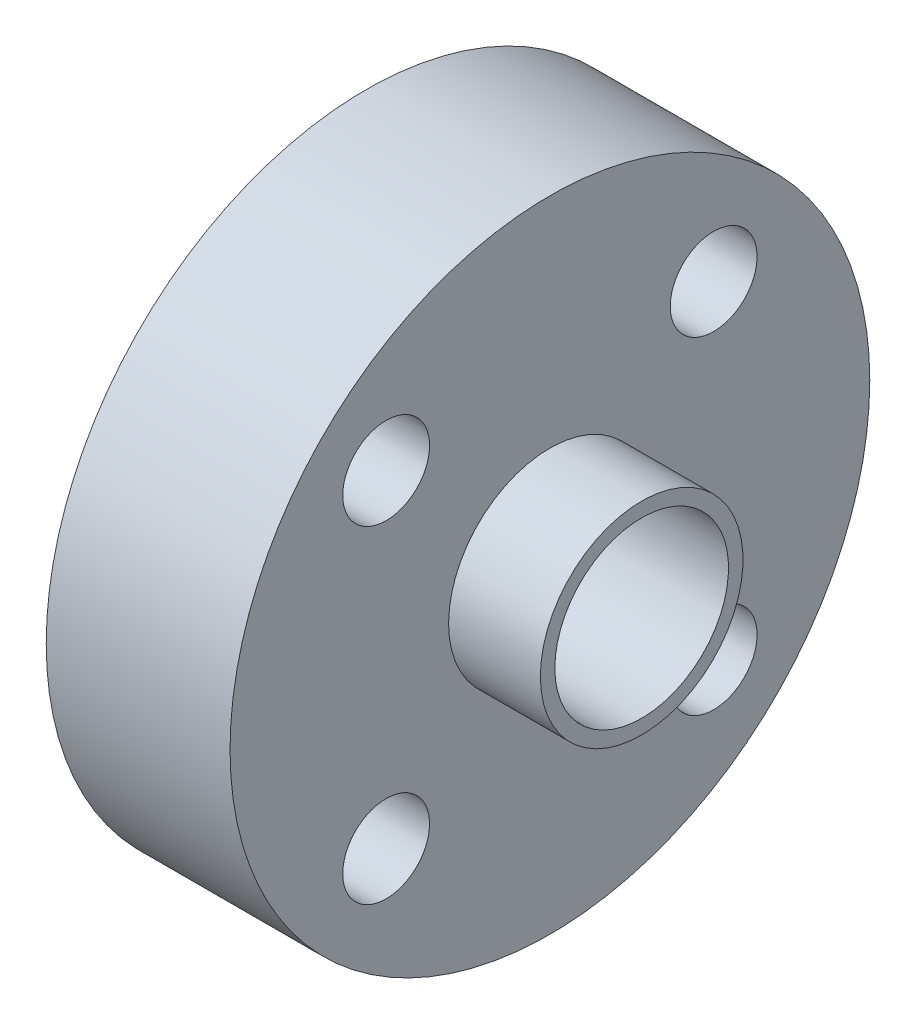
ISO-10303-21;
HEADER;
FILE_DESCRIPTION(('STEP AP214'),'2;1');
FILE_NAME('part.step','',(''),(''),'','','');
FILE_SCHEMA(('AUTOMOTIVE_DESIGN { 1 0 10303 214 1 1 1 1 }'));
ENDSEC;
DATA;
#1=APPLICATION_CONTEXT('core data for automotive mechanical design processes');
#2=APPLICATION_PROTOCOL_DEFINITION('international standard','automotive_design',2000,#1);
#3=PRODUCT_CONTEXT('',#1,'mechanical');
#4=PRODUCT('Part','Part','',(#3));
#5=PRODUCT_RELATED_PRODUCT_CATEGORY('part','',(#4));
#6=PRODUCT_DEFINITION_FORMATION('','',#4);
#7=PRODUCT_DEFINITION_CONTEXT('part definition',#1,'design');
#8=PRODUCT_DEFINITION('design','',#6,#7);
#9=PRODUCT_DEFINITION_SHAPE('','',#8);
#10=(LENGTH_UNIT() NAMED_UNIT(*) SI_UNIT(.MILLI.,.METRE.));
#11=(NAMED_UNIT(*) PLANE_ANGLE_UNIT() SI_UNIT($,.RADIAN.));
#12=(NAMED_UNIT(*) SI_UNIT($,.STERADIAN.) SOLID_ANGLE_UNIT());
#13=UNCERTAINTY_MEASURE_WITH_UNIT(LENGTH_MEASURE(1.E-05),#10,'distance_accuracy_value','');
#14=(GEOMETRIC_REPRESENTATION_CONTEXT(3) GLOBAL_UNCERTAINTY_ASSIGNED_CONTEXT((#13)) GLOBAL_UNIT_ASSIGNED_CONTEXT((#10,
#11,#12)) REPRESENTATION_CONTEXT('',''));
#15=CARTESIAN_POINT('',(0.,0.,0.));
#16=DIRECTION('',(0.,0.,1.));
#17=DIRECTION('',(1.,0.,0.));
#18=AXIS2_PLACEMENT_3D('',#15,#16,#17);
#19=CARTESIAN_POINT('',(-40.2001302083333,0.,0.));
#20=DIRECTION('',(1.,0.,0.));
#21=DIRECTION('',(0.,0.,-1.));
#22=AXIS2_PLACEMENT_3D('',#19,#20,#21);
#23=PLANE('',#22);
#24=CARTESIAN_POINT('',(-40.2001302083333,0.,0.));
#25=DIRECTION('',(-1.,0.,0.));
#26=DIRECTION('',(0.,0.,1.));
#27=AXIS2_PLACEMENT_3D('',#24,#25,#26);
#28=CIRCLE('',#27,3.);
#29=CARTESIAN_POINT('',(-40.2001302083333,0.,3.));
#30=VERTEX_POINT('',#29);
#31=EDGE_CURVE('E54',#30,#30,#28,.T.);
#32=ORIENTED_EDGE('',*,*,#31,.F.);
#33=EDGE_LOOP('',(#32));
#34=FACE_BOUND('',#33,.T.);
#35=CARTESIAN_POINT('',(-40.2001302083333,0.,0.));
#36=DIRECTION('',(-1.,0.,0.));
#37=DIRECTION('',(0.,0.,1.));
#38=AXIS2_PLACEMENT_3D('',#35,#36,#37);
#39=CIRCLE('',#38,4.7);
#40=CARTESIAN_POINT('',(-40.2001302083333,0.,4.7));
#41=VERTEX_POINT('',#40);
#42=EDGE_CURVE('E10',#41,#41,#39,.T.);
#43=ORIENTED_EDGE('',*,*,#42,.T.);
#44=EDGE_LOOP('',(#43));
#45=FACE_BOUND('',#44,.T.);
#46=ADVANCED_FACE('F31',(#34,#45),#23,.F.);
#47=CARTESIAN_POINT('',(-53.2970052083333,0.,0.));
#48=DIRECTION('',(-1.,0.,0.));
#49=DIRECTION('',(0.,0.,1.));
#50=AXIS2_PLACEMENT_3D('',#47,#48,#49);
#51=CYLINDRICAL_SURFACE('',#50,4.7);
#52=ORIENTED_EDGE('',*,*,#42,.F.);
#53=EDGE_LOOP('',(#52));
#54=FACE_BOUND('',#53,.T.);
#55=CARTESIAN_POINT('',(-37.0201302083333,0.,0.));
#56=DIRECTION('',(-1.,0.,0.));
#57=DIRECTION('',(0.,0.,1.));
#58=AXIS2_PLACEMENT_3D('',#55,#56,#57);
#59=CIRCLE('',#58,4.7);
#60=CARTESIAN_POINT('',(-37.0201302083333,0.,4.7));
#61=VERTEX_POINT('',#60);
#62=EDGE_CURVE('E42',#61,#61,#59,.T.);
#63=ORIENTED_EDGE('',*,*,#62,.T.);
#64=EDGE_LOOP('',(#63));
#65=FACE_BOUND('',#64,.T.);
#66=ADVANCED_FACE('F132',(#54,#65),#51,.T.);
#67=CARTESIAN_POINT('',(-37.0201302083333,0.,-4.7));
#68=DIRECTION('',(1.,0.,0.));
#69=DIRECTION('',(0.,0.,-1.));
#70=AXIS2_PLACEMENT_3D('',#67,#68,#69);
#71=PLANE('',#70);
#72=CARTESIAN_POINT('',(-37.0201302083333,5.65685424949245,5.65685424949231));
#73=DIRECTION('',(-1.,0.,0.));
#74=DIRECTION('',(0.,-1.,0.));
#75=AXIS2_PLACEMENT_3D('',#72,#73,#74);
#76=CIRCLE('',#75,1.5);
#77=CARTESIAN_POINT('',(-37.0201302083333,4.15685424949245,5.65685424949233));
#78=VERTEX_POINT('',#77);
#79=EDGE_CURVE('E65',#78,#78,#76,.T.);
#80=ORIENTED_EDGE('',*,*,#79,.F.);
#81=EDGE_LOOP('',(#80));
#82=FACE_BOUND('',#81,.T.);
#83=CARTESIAN_POINT('',(-37.0201302083333,-5.65685424949237,5.65685424949239));
#84=DIRECTION('',(-1.,0.,0.));
#85=DIRECTION('',(0.,0.,-1.));
#86=AXIS2_PLACEMENT_3D('',#83,#84,#85);
#87=CIRCLE('',#86,1.5);
#88=CARTESIAN_POINT('',(-37.0201302083333,-5.65685424949237,4.15685424949239));
#89=VERTEX_POINT('',#88);
#90=EDGE_CURVE('E62',#89,#89,#87,.T.);
#91=ORIENTED_EDGE('',*,*,#90,.F.);
#92=EDGE_LOOP('',(#91));
#93=FACE_BOUND('',#92,.T.);
#94=CARTESIAN_POINT('',(-37.0201302083333,-5.65685424949241,-5.65685424949235));
#95=DIRECTION('',(-1.,0.,0.));
#96=DIRECTION('',(0.,1.,0.));
#97=AXIS2_PLACEMENT_3D('',#94,#95,#96);
#98=CIRCLE('',#97,1.5);
#99=CARTESIAN_POINT('',(-37.0201302083333,-4.15685424949241,-5.65685424949235));
#100=VERTEX_POINT('',#99);
#101=EDGE_CURVE('E59',#100,#100,#98,.T.);
#102=ORIENTED_EDGE('',*,*,#101,.F.);
#103=EDGE_LOOP('',(#102));
#104=FACE_BOUND('',#103,.T.);
#105=CARTESIAN_POINT('',(-37.0201302083333,5.65685424949237,-5.65685424949239));
#106=DIRECTION('',(-1.,0.,0.));
#107=DIRECTION('',(0.,0.,1.));
#108=AXIS2_PLACEMENT_3D('',#105,#106,#107);
#109=CIRCLE('',#108,1.5);
#110=CARTESIAN_POINT('',(-37.0201302083333,5.65685424949237,-4.15685424949239));
#111=VERTEX_POINT('',#110);
#112=EDGE_CURVE('E55',#111,#111,#109,.T.);
#113=ORIENTED_EDGE('',*,*,#112,.F.);
#114=EDGE_LOOP('',(#113));
#115=FACE_BOUND('',#114,.T.);
#116=ORIENTED_EDGE('',*,*,#62,.F.);
#117=EDGE_LOOP('',(#116));
#118=FACE_BOUND('',#117,.T.);
#119=CARTESIAN_POINT('',(-37.0201302083333,0.,0.));
#120=DIRECTION('',(-1.,0.,0.));
#121=DIRECTION('',(0.,0.,1.));
#122=AXIS2_PLACEMENT_3D('',#119,#120,#121);
#123=CIRCLE('',#122,11.05);
#124=CARTESIAN_POINT('',(-37.0201302083333,0.,11.05));
#125=VERTEX_POINT('',#124);
#126=EDGE_CURVE('E47',#125,#125,#123,.T.);
#127=ORIENTED_EDGE('',*,*,#126,.T.);
#128=EDGE_LOOP('',(#127));
#129=FACE_BOUND('',#128,.T.);
#130=ADVANCED_FACE('F101',(#82,#93,#104,#115,#118,#129),#71,.F.);
#131=CARTESIAN_POINT('',(-53.2970052083333,0.,0.));
#132=DIRECTION('',(-1.,0.,0.));
#133=DIRECTION('',(0.,0.,1.));
#134=AXIS2_PLACEMENT_3D('',#131,#132,#133);
#135=CYLINDRICAL_SURFACE('',#134,11.05);
#136=CARTESIAN_POINT('',(-31.3451302083333,0.,-11.05));
#137=CARTESIAN_POINT('',(-31.3451347657817,0.138535178969198,-11.0499974686992));
#138=CARTESIAN_POINT('',(-31.3566842583246,0.277124414870294,-11.047368394039));
#139=CARTESIAN_POINT('',(-31.4025242809649,0.55035816038072,-11.0371346033821));
#140=CARTESIAN_POINT('',(-31.4368302897828,0.684999919826578,-11.0295265007553));
#141=CARTESIAN_POINT('',(-31.5270473952303,0.946351146069514,-11.0101807046834));
#142=CARTESIAN_POINT('',(-31.5829351392618,1.07306901532559,-10.9984474760714));
#143=CARTESIAN_POINT('',(-31.7146532533677,1.31532636423872,-10.9721139075424));
#144=CARTESIAN_POINT('',(-31.790483386229,1.43086597683789,-10.9575136017296));
#145=CARTESIAN_POINT('',(-31.9613051967248,1.64946582897903,-10.9267629293887));
#146=CARTESIAN_POINT('',(-32.0565727961294,1.75230761065863,-10.9105922318907));
#147=CARTESIAN_POINT('',(-32.2629732528739,1.94069721632042,-10.878664647576));
#148=CARTESIAN_POINT('',(-32.3741076035238,2.02624341068387,-10.8629077998747));
#149=CARTESIAN_POINT('',(-32.6107206403364,2.17859183261036,-10.8333905461894));
#150=CARTESIAN_POINT('',(-32.7363543412377,2.24515879528731,-10.8196561403144));
#151=CARTESIAN_POINT('',(-32.9973875487626,2.35614919880918,-10.796031791589));
#152=CARTESIAN_POINT('',(-33.1327857969257,2.40057548733988,-10.7861413543717));
#153=CARTESIAN_POINT('',(-33.4071271573634,2.46529609887246,-10.7715323060186));
#154=CARTESIAN_POINT('',(-33.5459741660384,2.48597862528871,-10.7667305989985));
#155=CARTESIAN_POINT('',(-33.8252439031697,2.5038321909553,-10.7625933128208));
#156=CARTESIAN_POINT('',(-33.965666421422,2.50100633029327,-10.7632570129314));
#157=CARTESIAN_POINT('',(-34.2411951057804,2.47223512536489,-10.7699004418861));
#158=CARTESIAN_POINT('',(-34.3763515328956,2.44674335015242,-10.775775873008));
#159=CARTESIAN_POINT('',(-34.6404182040461,2.37408365604073,-10.7920155533678));
#160=CARTESIAN_POINT('',(-34.7693280752597,2.32691444509448,-10.802380070168));
#161=CARTESIAN_POINT('',(-35.0185038963537,2.21182931829656,-10.8265312521615));
#162=CARTESIAN_POINT('',(-35.1386874920297,2.143741260663,-10.8403461270284));
#163=CARTESIAN_POINT('',(-35.3660900945078,1.9888720895275,-10.8698244596064));
#164=CARTESIAN_POINT('',(-35.4733072141066,1.90208826005324,-10.8854881857544));
#165=CARTESIAN_POINT('',(-35.6743420550986,1.70990181962498,-10.9173449250341));
#166=CARTESIAN_POINT('',(-35.7677914578564,1.60411416676263,-10.9335417895284));
#167=CARTESIAN_POINT('',(-35.9356854127979,1.37818254775952,-10.9643098473388));
#168=CARTESIAN_POINT('',(-36.010129572383,1.25803828512407,-10.9788810070688));
#169=CARTESIAN_POINT('',(-36.1380007993904,1.00633702781466,-11.0048085021139));
#170=CARTESIAN_POINT('',(-36.1913769690913,0.874753320469848,-11.0161570336327));
#171=CARTESIAN_POINT('',(-36.2751567132021,0.604169833161706,-11.034302968742));
#172=CARTESIAN_POINT('',(-36.3055638674121,0.465171212454925,-11.0411010815121));
#173=CARTESIAN_POINT('',(-36.3420006144425,0.186860495275626,-11.0492783517252));
#174=CARTESIAN_POINT('',(-36.348532963223,0.0476174133332158,-11.0507692507554));
#175=CARTESIAN_POINT('',(-36.3384010777072,-0.229970622720129,-11.0484784130789));
#176=CARTESIAN_POINT('',(-36.3217385329043,-0.36831564150772,-11.0446970603979));
#177=CARTESIAN_POINT('',(-36.266106270829,-0.638496033310976,-11.0323573731012));
#178=CARTESIAN_POINT('',(-36.2274026793795,-0.770389039953454,-11.0238560579555));
#179=CARTESIAN_POINT('',(-36.1290843232459,-1.02580957081328,-11.0030291180397));
#180=CARTESIAN_POINT('',(-36.0694676937165,-1.14933634782964,-10.9907031522313));
#181=CARTESIAN_POINT('',(-35.9299849441036,-1.38657900576045,-10.9633201008813));
#182=CARTESIAN_POINT('',(-35.8498266113306,-1.50011854849276,-10.9482245809437));
#183=CARTESIAN_POINT('',(-35.6719179909027,-1.71231494298578,-10.9170508820538));
#184=CARTESIAN_POINT('',(-35.5741652473163,-1.8109697135039,-10.9009725661242));
#185=CARTESIAN_POINT('',(-35.3615286403444,-1.99260346932019,-10.8692556152757));
#186=CARTESIAN_POINT('',(-35.2463437507104,-2.07523317138076,-10.8536320018118));
#187=CARTESIAN_POINT('',(-35.0034379902651,-2.21997934847289,-10.8249553465839));
#188=CARTESIAN_POINT('',(-34.8757176727781,-2.2820967284078,-10.811902191434));
#189=CARTESIAN_POINT('',(-34.6120603059594,-2.38362200906372,-10.7899743136361));
#190=CARTESIAN_POINT('',(-34.4761756340373,-2.42316049546664,-10.7810756193173));
#191=CARTESIAN_POINT('',(-34.1994620634576,-2.47878112159198,-10.7684248029988));
#192=CARTESIAN_POINT('',(-34.0586340239648,-2.49486731688939,-10.7646717911695));
#193=CARTESIAN_POINT('',(-33.7795599813477,-2.50294484254296,-10.7627961003508));
#194=CARTESIAN_POINT('',(-33.6413306207192,-2.49549089532478,-10.7645437941672));
#195=CARTESIAN_POINT('',(-33.3681529987284,-2.45794659316738,-10.7731779308509));
#196=CARTESIAN_POINT('',(-33.2332046929824,-2.42785654460879,-10.7800643041659));
#197=CARTESIAN_POINT('',(-32.970897725627,-2.34617054677613,-10.7981345431471));
#198=CARTESIAN_POINT('',(-32.8435109873545,-2.29466069270581,-10.8093011906911));
#199=CARTESIAN_POINT('',(-32.5991070426896,-2.17166931112005,-10.8346794116197));
#200=CARTESIAN_POINT('',(-32.4820910044047,-2.10018553759107,-10.8488913273947));
#201=CARTESIAN_POINT('',(-32.2590276686996,-1.9374587803661,-10.8791419628974));
#202=CARTESIAN_POINT('',(-32.1532714643818,-1.84582279327649,-10.8952134785653));
#203=CARTESIAN_POINT('',(-31.958455816679,-1.64618244704617,-10.9271580559927));
#204=CARTESIAN_POINT('',(-31.8694002557157,-1.53817429237176,-10.9430310708079));
#205=CARTESIAN_POINT('',(-31.7093064502271,-1.30701989814213,-10.9730559944475));
#206=CARTESIAN_POINT('',(-31.6385398358246,-1.18368175489585,-10.9871804925533));
#207=CARTESIAN_POINT('',(-31.5188556185285,-0.926563557240404,-11.0118391408392));
#208=CARTESIAN_POINT('',(-31.4699202891328,-0.792792078539198,-11.0223762022827));
#209=CARTESIAN_POINT('',(-31.403680853684,-0.549137810072976,-11.0368651946442));
#210=CARTESIAN_POINT('',(-31.3817674791712,-0.440540462306541,-11.0417594976069));
#211=CARTESIAN_POINT('',(-31.3524907030212,-0.221306840345493,-11.0483278301591));
#212=CARTESIAN_POINT('',(-31.3451265675551,-0.110670669268363,-11.0500020221633));
#213=CARTESIAN_POINT('',(-31.3451302083333,0.,-11.05));
#214=B_SPLINE_CURVE_WITH_KNOTS('',3,(#136,#137,#138,#139,#140,#141,#142,#143,#144,#145,#146,
#147,#148,#149,#150,#151,#152,#153,#154,#155,#156,#157,#158,#159,#160,#161,#162,#163,#164,#165,
#166,#167,#168,#169,#170,#171,#172,#173,#174,#175,#176,#177,#178,#179,#180,#181,#182,#183,#184,
#185,#186,#187,#188,#189,#190,#191,#192,#193,#194,#195,#196,#197,#198,#199,#200,#201,#202,#203,
#204,#205,#206,#207,#208,#209,#210,#211,#212,#213),.UNSPECIFIED.,.T.,.F.,(4,2,2,2,2,2,2,2,2,2,2,
2,2,2,2,2,2,2,2,2,2,2,2,2,2,2,2,2,2,2,2,2,2,2,2,2,2,2,4),(0.,0.415200333937034,
0.830683372350487,1.2457180898483,1.66074787076434,2.0821399607225,2.50357173645346,
2.9300205273311,3.35641445512039,3.77573297448606,4.19499619854192,4.60605374648434,
5.0171357979976,5.43169561673744,5.8463157000748,6.27054919340257,6.69479144957406,
7.1200524409568,7.54524714026966,7.96143474948825,8.37759204559127,8.78882803282417,
9.20010069988188,9.61758444403025,10.0351265082735,10.4609407255014,10.886736155378,
11.3100433735258,11.7332773810064,12.1466129574272,12.5599429394333,12.9716273913896,
13.3833581547979,13.8039713364727,14.2246821777895,14.6513225995566,15.0776159657674,
15.4093210026298,15.7410093086555),.UNSPECIFIED.);
#215=CARTESIAN_POINT('',(-31.3451302083333,0.,-11.05));
#216=VERTEX_POINT('',#215);
#217=EDGE_CURVE('E71',#216,#216,#214,.T.);
#218=ORIENTED_EDGE('',*,*,#217,.T.);
#219=EDGE_LOOP('',(#218));
#220=FACE_BOUND('',#219,.T.);
#221=ORIENTED_EDGE('',*,*,#126,.F.);
#222=EDGE_LOOP('',(#221));
#223=FACE_BOUND('',#222,.T.);
#224=CARTESIAN_POINT('',(-30.6701302083333,0.,0.));
#225=DIRECTION('',(-1.,0.,0.));
#226=DIRECTION('',(0.,0.,1.));
#227=AXIS2_PLACEMENT_3D('',#224,#225,#226);
#228=CIRCLE('',#227,11.05);
#229=CARTESIAN_POINT('',(-30.6701302083333,0.,11.05));
#230=VERTEX_POINT('',#229);
#231=EDGE_CURVE('E96',#230,#230,#228,.T.);
#232=ORIENTED_EDGE('',*,*,#231,.T.);
#233=EDGE_LOOP('',(#232));
#234=FACE_BOUND('',#233,.T.);
#235=ADVANCED_FACE('F103',(#220,#223,#234),#135,.T.);
#236=CARTESIAN_POINT('',(-30.6701302083333,0.,-11.05));
#237=DIRECTION('',(-1.,0.,0.));
#238=DIRECTION('',(0.,0.,1.));
#239=AXIS2_PLACEMENT_3D('',#236,#237,#238);
#240=PLANE('',#239);
#241=CARTESIAN_POINT('',(-30.6701302083333,5.65685424949245,5.65685424949231));
#242=DIRECTION('',(-1.,0.,0.));
#243=DIRECTION('',(0.,0.,1.));
#244=AXIS2_PLACEMENT_3D('',#241,#242,#243);
#245=CIRCLE('',#244,1.5);
#246=CARTESIAN_POINT('',(-30.6701302083333,5.65685424949245,7.15685424949231));
#247=VERTEX_POINT('',#246);
#248=EDGE_CURVE('E63',#247,#247,#245,.T.);
#249=ORIENTED_EDGE('',*,*,#248,.T.);
#250=EDGE_LOOP('',(#249));
#251=FACE_BOUND('',#250,.T.);
#252=CARTESIAN_POINT('',(-30.6701302083333,-5.65685424949237,5.65685424949239));
#253=DIRECTION('',(-1.,0.,0.));
#254=DIRECTION('',(0.,0.,1.));
#255=AXIS2_PLACEMENT_3D('',#252,#253,#254);
#256=CIRCLE('',#255,1.5);
#257=CARTESIAN_POINT('',(-30.6701302083333,-5.65685424949237,7.15685424949239));
#258=VERTEX_POINT('',#257);
#259=EDGE_CURVE('E60',#258,#258,#256,.T.);
#260=ORIENTED_EDGE('',*,*,#259,.T.);
#261=EDGE_LOOP('',(#260));
#262=FACE_BOUND('',#261,.T.);
#263=CARTESIAN_POINT('',(-30.6701302083333,-5.65685424949241,-5.65685424949235));
#264=DIRECTION('',(-1.,0.,0.));
#265=DIRECTION('',(0.,0.,1.));
#266=AXIS2_PLACEMENT_3D('',#263,#264,#265);
#267=CIRCLE('',#266,1.5);
#268=CARTESIAN_POINT('',(-30.6701302083333,-5.65685424949241,-4.15685424949235));
#269=VERTEX_POINT('',#268);
#270=EDGE_CURVE('E56',#269,#269,#267,.T.);
#271=ORIENTED_EDGE('',*,*,#270,.T.);
#272=EDGE_LOOP('',(#271));
#273=FACE_BOUND('',#272,.T.);
#274=CARTESIAN_POINT('',(-30.6701302083333,5.65685424949237,-5.65685424949239));
#275=DIRECTION('',(-1.,0.,0.));
#276=DIRECTION('',(0.,0.,1.));
#277=AXIS2_PLACEMENT_3D('',#274,#275,#276);
#278=CIRCLE('',#277,1.5);
#279=CARTESIAN_POINT('',(-30.6701302083333,5.65685424949237,-4.15685424949239));
#280=VERTEX_POINT('',#279);
#281=EDGE_CURVE('E51',#280,#280,#278,.T.);
#282=ORIENTED_EDGE('',*,*,#281,.T.);
#283=EDGE_LOOP('',(#282));
#284=FACE_BOUND('',#283,.T.);
#285=ORIENTED_EDGE('',*,*,#231,.F.);
#286=EDGE_LOOP('',(#285));
#287=FACE_BOUND('',#286,.T.);
#288=CARTESIAN_POINT('',(-30.6701302083333,0.,0.));
#289=DIRECTION('',(-1.,0.,0.));
#290=DIRECTION('',(0.,0.,1.));
#291=AXIS2_PLACEMENT_3D('',#288,#289,#290);
#292=CIRCLE('',#291,3.5);
#293=CARTESIAN_POINT('',(-30.6701302083333,0.,3.5));
#294=VERTEX_POINT('',#293);
#295=EDGE_CURVE('E93',#294,#294,#292,.T.);
#296=ORIENTED_EDGE('',*,*,#295,.T.);
#297=EDGE_LOOP('',(#296));
#298=FACE_BOUND('',#297,.T.);
#299=ADVANCED_FACE('F106',(#251,#262,#273,#284,#287,#298),#240,.F.);
#300=CARTESIAN_POINT('',(-53.2970052083333,0.,0.));
#301=DIRECTION('',(-1.,0.,0.));
#302=DIRECTION('',(0.,0.,1.));
#303=AXIS2_PLACEMENT_3D('',#300,#301,#302);
#304=CYLINDRICAL_SURFACE('',#303,3.5);
#305=ORIENTED_EDGE('',*,*,#295,.F.);
#306=EDGE_LOOP('',(#305));
#307=FACE_BOUND('',#306,.T.);
#308=CARTESIAN_POINT('',(-27.5001302083333,0.,0.));
#309=DIRECTION('',(-1.,0.,0.));
#310=DIRECTION('',(0.,0.,1.));
#311=AXIS2_PLACEMENT_3D('',#308,#309,#310);
#312=CIRCLE('',#311,3.5);
#313=CARTESIAN_POINT('',(-27.5001302083333,0.,3.5));
#314=VERTEX_POINT('',#313);
#315=EDGE_CURVE('E88',#314,#314,#312,.T.);
#316=ORIENTED_EDGE('',*,*,#315,.T.);
#317=EDGE_LOOP('',(#316));
#318=FACE_BOUND('',#317,.T.);
#319=ADVANCED_FACE('F112',(#307,#318),#304,.T.);
#320=CARTESIAN_POINT('',(-27.5001302083333,0.,-3.5));
#321=DIRECTION('',(-1.,0.,0.));
#322=DIRECTION('',(0.,0.,1.));
#323=AXIS2_PLACEMENT_3D('',#320,#321,#322);
#324=PLANE('',#323);
#325=CARTESIAN_POINT('',(-27.5001302083333,0.,0.));
#326=DIRECTION('',(-1.,0.,0.));
#327=DIRECTION('',(0.,0.,1.));
#328=AXIS2_PLACEMENT_3D('',#325,#326,#327);
#329=CIRCLE('',#328,3.);
#330=CARTESIAN_POINT('',(-27.5001302083333,0.,3.));
#331=VERTEX_POINT('',#330);
#332=EDGE_CURVE('E85',#331,#331,#329,.T.);
#333=ORIENTED_EDGE('',*,*,#332,.T.);
#334=EDGE_LOOP('',(#333));
#335=FACE_BOUND('',#334,.T.);
#336=ORIENTED_EDGE('',*,*,#315,.F.);
#337=EDGE_LOOP('',(#336));
#338=FACE_BOUND('',#337,.T.);
#339=ADVANCED_FACE('F118',(#335,#338),#324,.F.);
#340=CARTESIAN_POINT('',(-27.5001302083333,0.,0.));
#341=DIRECTION('',(-1.,0.,0.));
#342=DIRECTION('',(0.,0.,1.));
#343=AXIS2_PLACEMENT_3D('',#340,#341,#342);
#344=CYLINDRICAL_SURFACE('',#343,3.);
#345=CARTESIAN_POINT('',(-31.3451302083333,0.,-3.));
#346=CARTESIAN_POINT('',(-31.345135093887,-0.118757533193203,-2.99999522795205));
#347=CARTESIAN_POINT('',(-31.3536527122379,-0.237551281104128,-2.99288670594742));
#348=CARTESIAN_POINT('',(-31.3870929316851,-0.471182492492811,-2.96510762868268));
#349=CARTESIAN_POINT('',(-31.4120276823086,-0.586016959612417,-2.94442702942008));
#350=CARTESIAN_POINT('',(-31.476442325666,-0.807829942407298,-2.89142690238865));
#351=CARTESIAN_POINT('',(-31.515835282687,-0.914850920904904,-2.8591769655007));
#352=CARTESIAN_POINT('',(-31.6071472562759,-1.11984139043408,-2.78529176182902));
#353=CARTESIAN_POINT('',(-31.6590705050066,-1.21780780775234,-2.74365332434936));
#354=CARTESIAN_POINT('',(-31.7945839581415,-1.43789998519767,-2.63674191529867));
#355=CARTESIAN_POINT('',(-31.8828004125155,-1.5556821965722,-2.56840549256191));
#356=CARTESIAN_POINT('',(-32.0756545340847,-1.77202398328147,-2.42422624777673));
#357=CARTESIAN_POINT('',(-32.1803377775764,-1.87052845158605,-2.34836281453276));
#358=CARTESIAN_POINT('',(-32.3492144848244,-2.00437263805588,-2.23294886313738));
#359=CARTESIAN_POINT('',(-32.4080857845246,-2.04699726278816,-2.19383679994997));
#360=CARTESIAN_POINT('',(-32.5296358112938,-2.12715295529554,-2.11620611809194));
#361=CARTESIAN_POINT('',(-32.5923158032041,-2.16468231743739,-2.07768770195023));
#362=CARTESIAN_POINT('',(-32.7213975326689,-2.23441122570747,-2.00250543288661));
#363=CARTESIAN_POINT('',(-32.7877899930581,-2.26662332666227,-1.9658373575465));
#364=CARTESIAN_POINT('',(-32.9245764922617,-2.32553690612792,-1.89577686630311));
#365=CARTESIAN_POINT('',(-32.9949670556751,-2.3522430799868,-1.86238167220904));
#366=CARTESIAN_POINT('',(-33.1467972985334,-2.40193513934006,-1.79791918980412));
#367=CARTESIAN_POINT('',(-33.2286543010568,-2.42433807692598,-1.76736311251003));
#368=CARTESIAN_POINT('',(-33.3970199771464,-2.46101313675502,-1.71593180556003));
#369=CARTESIAN_POINT('',(-33.483516794948,-2.47530499393792,-1.69503310194197));
#370=CARTESIAN_POINT('',(-33.6608956167128,-2.49481072799048,-1.66620928968844));
#371=CARTESIAN_POINT('',(-33.751818167404,-2.49991205058667,-1.65844510563092));
#372=CARTESIAN_POINT('',(-33.9336928213361,-2.5000856937119,-1.65818308531825));
#373=CARTESIAN_POINT('',(-34.0246449249487,-2.49515788278405,-1.66568544916939));
#374=CARTESIAN_POINT('',(-34.2106549191604,-2.47505262029594,-1.69541639464497));
#375=CARTESIAN_POINT('',(-34.3054239540504,-2.45905577113332,-1.71881932066466));
#376=CARTESIAN_POINT('',(-34.4893411895355,-2.41742550503028,-1.77688235738913));
#377=CARTESIAN_POINT('',(-34.5784695790481,-2.3917601104429,-1.81157977103024));
#378=CARTESIAN_POINT('',(-34.7329572868744,-2.33816270346874,-1.88002226126136));
#379=CARTESIAN_POINT('',(-34.799442450745,-2.31177513033566,-1.91250316845438));
#380=CARTESIAN_POINT('',(-34.9287810151132,-2.25404424958637,-1.98021996661529));
#381=CARTESIAN_POINT('',(-34.9916322561992,-2.22269803586306,-2.01545746697785));
#382=CARTESIAN_POINT('',(-35.175097049353,-2.12149677560466,-2.12342648109724));
#383=CARTESIAN_POINT('',(-35.2905443559394,-2.04450664231778,-2.19837696967437));
#384=CARTESIAN_POINT('',(-35.5133971707877,-1.86765914501415,-2.35079897952277));
#385=CARTESIAN_POINT('',(-35.6200685323252,-1.76681805277629,-2.42819792618944));
#386=CARTESIAN_POINT('',(-35.8162425531507,-1.5448438833615,-2.57509054043284));
#387=CARTESIAN_POINT('',(-35.9057822413896,-1.42375565615774,-2.64460112267363));
#388=CARTESIAN_POINT('',(-36.0445450474319,-1.19411179169417,-2.75428914126547));
#389=CARTESIAN_POINT('',(-36.098273106521,-1.08972732107278,-2.79748350073995));
#390=CARTESIAN_POINT('',(-36.1914729535887,-0.871071458330379,-2.87307804019801));
#391=CARTESIAN_POINT('',(-36.2309536399139,-0.756806292780775,-2.90548495660805));
#392=CARTESIAN_POINT('',(-36.2935474582655,-0.51995430121543,-2.95709834265565));
#393=CARTESIAN_POINT('',(-36.3165341549909,-0.397310923125319,-2.97620280955844));
#394=CARTESIAN_POINT('',(-36.3438394402605,-0.148559976923737,-2.99891434528972));
#395=CARTESIAN_POINT('',(-36.3481705191835,-0.0224547835240113,-3.00253178304177));
#396=CARTESIAN_POINT('',(-36.3384677688896,0.213310199456566,-2.99444999039147));
#397=CARTESIAN_POINT('',(-36.3265715696182,0.32313054083585,-2.98453350716313));
#398=CARTESIAN_POINT('',(-36.2888632581218,0.538644964400596,-2.95325589460136));
#399=CARTESIAN_POINT('',(-36.2630494766144,0.644338549989553,-2.93189339242796));
#400=CARTESIAN_POINT('',(-36.1985068128781,0.850565499199248,-2.87889521546186));
#401=CARTESIAN_POINT('',(-36.1596094188891,0.951010682223306,-2.84712564891975));
#402=CARTESIAN_POINT('',(-36.0707345759966,1.14365900898103,-2.7753612473389));
#403=CARTESIAN_POINT('',(-36.02075303134,1.23585908831209,-2.73536337221809));
#404=CARTESIAN_POINT('',(-35.8866984129864,1.45067439735099,-2.62975152158594));
#405=CARTESIAN_POINT('',(-35.797397625066,1.5683435954073,-2.56070244234715));
#406=CARTESIAN_POINT('',(-35.6022898256777,1.78428994740847,-2.41522445403191));
#407=CARTESIAN_POINT('',(-35.4964317529786,1.88250490855172,-2.33877300422835));
#408=CARTESIAN_POINT('',(-35.3257182404047,2.0157331478429,-2.22269805598601));
#409=CARTESIAN_POINT('',(-35.2662319353573,2.05811069143949,-2.1834115173603));
#410=CARTESIAN_POINT('',(-35.1434093923011,2.13771669597406,-2.10553153817181));
#411=CARTESIAN_POINT('',(-35.0800717806692,2.17494330406755,-2.06693835133607));
#412=CARTESIAN_POINT('',(-34.9496418044181,2.24398857026757,-1.9917610848264));
#413=CARTESIAN_POINT('',(-34.8825599837997,2.27582148781537,-1.95517188634212));
#414=CARTESIAN_POINT('',(-34.7443401038335,2.33388856739459,-1.88547561448179));
#415=CARTESIAN_POINT('',(-34.673205837914,2.36012785984655,-1.85236536450791));
#416=CARTESIAN_POINT('',(-34.5208598399815,2.40837357148322,-1.78925557416047));
#417=CARTESIAN_POINT('',(-34.4392957572596,2.42988314318544,-1.75970711786654));
#418=CARTESIAN_POINT('',(-34.2716782543907,2.46482255689514,-1.71043063887427));
#419=CARTESIAN_POINT('',(-34.1856366370055,2.47827257713357,-1.69067811225259));
#420=CARTESIAN_POINT('',(-34.009492600921,2.49617289535263,-1.6641531597946));
#421=CARTESIAN_POINT('',(-33.9193548785827,2.5005179918396,-1.65753251048391));
#422=CARTESIAN_POINT('',(-33.7392769955494,2.49938197104456,-1.65924308630666));
#423=CARTESIAN_POINT('',(-33.6493368932082,2.49389826274012,-1.66757825402154));
#424=CARTESIAN_POINT('',(-33.4634576329428,2.47265263848541,-1.69892898735519));
#425=CARTESIAN_POINT('',(-33.3678999378007,2.45585812550762,-1.72341371023857));
#426=CARTESIAN_POINT('',(-33.1825989122506,2.41250339675092,-1.78358728037387));
#427=CARTESIAN_POINT('',(-33.092875979624,2.38591088285909,-1.81931312531326));
#428=CARTESIAN_POINT('',(-32.9373411669785,2.33050835844919,-1.88952619366194));
#429=CARTESIAN_POINT('',(-32.8703864490984,2.30325853049531,-1.92277816627791));
#430=CARTESIAN_POINT('',(-32.7401838219089,2.24370627018012,-1.9919518523057));
#431=CARTESIAN_POINT('',(-32.6769380973335,2.21140090020864,-2.0278751115052));
#432=CARTESIAN_POINT('',(-32.4924006469914,2.10716294428985,-2.13775931167912));
#433=CARTESIAN_POINT('',(-32.3763832833414,2.02793576743751,-2.2137978016432));
#434=CARTESIAN_POINT('',(-32.1531229470421,1.84629697567414,-2.36772603763546));
#435=CARTESIAN_POINT('',(-32.0465884143004,1.7429395959328,-2.44552394429512));
#436=CARTESIAN_POINT('',(-31.851266408794,1.51553554935621,-2.59256498427755));
#437=CARTESIAN_POINT('',(-31.7624396424594,1.39153583663215,-2.66182692543068));
#438=CARTESIAN_POINT('',(-31.6268160116102,1.15855518141083,-2.76942305781508));
#439=CARTESIAN_POINT('',(-31.5750916981139,1.05399877947693,-2.81112174006883));
#440=CARTESIAN_POINT('',(-31.4859115380947,0.835439786054356,-2.88361460666453));
#441=CARTESIAN_POINT('',(-31.448436684238,0.721450026753901,-2.9144233132377));
#442=CARTESIAN_POINT('',(-31.3949417525067,0.506620038886855,-2.95858745904691));
#443=CARTESIAN_POINT('',(-31.3763550861065,0.406845468761922,-2.97402142398111));
#444=CARTESIAN_POINT('',(-31.3514478400952,0.204722725654237,-2.99472922794408));
#445=CARTESIAN_POINT('',(-31.3451259967464,0.102374818922784,-3.00000411373941));
#446=CARTESIAN_POINT('',(-31.3451302083333,0.,-3.));
#447=B_SPLINE_CURVE_WITH_KNOTS('',3,(#345,#346,#347,#348,#349,#350,#351,#352,#353,#354,#355,
#356,#357,#358,#359,#360,#361,#362,#363,#364,#365,#366,#367,#368,#369,#370,#371,#372,#373,#374,
#375,#376,#377,#378,#379,#380,#381,#382,#383,#384,#385,#386,#387,#388,#389,#390,#391,#392,#393,
#394,#395,#396,#397,#398,#399,#400,#401,#402,#403,#404,#405,#406,#407,#408,#409,#410,#411,#412,
#413,#414,#415,#416,#417,#418,#419,#420,#421,#422,#423,#424,#425,#426,#427,#428,#429,#430,#431,
#432,#433,#434,#435,#436,#437,#438,#439,#440,#441,#442,#443,#444,#445,#446),.UNSPECIFIED.,.T.,
.F.,(4,2,2,2,2,2,2,2,2,2,2,2,2,2,2,2,2,2,2,2,2,2,2,2,2,2,2,2,2,2,2,2,2,2,2,2,2,2,2,2,2,2,2,2,2,
2,2,2,2,2,4),(0.,0.355841276815113,0.711946191026962,1.06594405359551,1.42006164830116,
1.90425178760127,2.38980643116775,2.63722280423449,2.88472179650724,3.13162777943677,
3.37832232674674,3.64812890035754,3.91727616616869,4.18969776924974,4.46212294312048,
4.75723524199722,5.05333228584568,5.28870178855694,5.52420974868633,5.9954933935898,
6.49137310548271,6.98616858956867,7.36002155957575,7.73364063000476,8.11009395319721,
8.48629519274361,8.81743460677927,9.14861374669872,9.48423297747607,9.81997643164434,
10.3065635514456,10.7946819775667,11.0432812121088,11.2919696391639,11.5399899810636,
11.787781852862,12.0551105531685,12.3217671309317,12.5914881373799,12.8612802568452,
13.1598101383752,13.4593330283462,13.6977271411687,13.9362602949129,14.4135864576438,
14.914300110886,15.413889999571,15.7841228897599,16.1538601797497,16.4606444271243,
16.7673970625124),.UNSPECIFIED.);
#448=CARTESIAN_POINT('',(-31.3451302083333,0.,-3.));
#449=VERTEX_POINT('',#448);
#450=EDGE_CURVE('E34',#449,#449,#447,.T.);
#451=ORIENTED_EDGE('',*,*,#450,.T.);
#452=EDGE_LOOP('',(#451));
#453=FACE_BOUND('',#452,.T.);
#454=ORIENTED_EDGE('',*,*,#332,.F.);
#455=EDGE_LOOP('',(#454));
#456=FACE_BOUND('',#455,.T.);
#457=ORIENTED_EDGE('',*,*,#31,.T.);
#458=EDGE_LOOP('',(#457));
#459=FACE_BOUND('',#458,.T.);
#460=ADVANCED_FACE('F123',(#453,#456,#459),#344,.F.);
#461=CARTESIAN_POINT('',(-27.0201302083333,5.65685424949237,-5.65685424949239));
#462=DIRECTION('',(-1.,0.,0.));
#463=DIRECTION('',(0.,0.,1.));
#464=AXIS2_PLACEMENT_3D('',#461,#462,#463);
#465=CYLINDRICAL_SURFACE('',#464,1.5);
#466=ORIENTED_EDGE('',*,*,#112,.T.);
#467=EDGE_LOOP('',(#466));
#468=FACE_BOUND('',#467,.T.);
#469=ORIENTED_EDGE('',*,*,#281,.F.);
#470=EDGE_LOOP('',(#469));
#471=FACE_BOUND('',#470,.T.);
#472=ADVANCED_FACE('F129',(#468,#471),#465,.F.);
#473=CARTESIAN_POINT('',(-27.0201302083333,-5.65685424949241,-5.65685424949235));
#474=DIRECTION('',(-1.,0.,0.));
#475=DIRECTION('',(0.,0.,1.));
#476=AXIS2_PLACEMENT_3D('',#473,#474,#475);
#477=CYLINDRICAL_SURFACE('',#476,1.5);
#478=ORIENTED_EDGE('',*,*,#101,.T.);
#479=EDGE_LOOP('',(#478));
#480=FACE_BOUND('',#479,.T.);
#481=ORIENTED_EDGE('',*,*,#270,.F.);
#482=EDGE_LOOP('',(#481));
#483=FACE_BOUND('',#482,.T.);
#484=ADVANCED_FACE('F160',(#480,#483),#477,.F.);
#485=CARTESIAN_POINT('',(-27.0201302083333,-5.65685424949237,5.65685424949239));
#486=DIRECTION('',(-1.,0.,0.));
#487=DIRECTION('',(0.,0.,1.));
#488=AXIS2_PLACEMENT_3D('',#485,#486,#487);
#489=CYLINDRICAL_SURFACE('',#488,1.5);
#490=ORIENTED_EDGE('',*,*,#90,.T.);
#491=EDGE_LOOP('',(#490));
#492=FACE_BOUND('',#491,.T.);
#493=ORIENTED_EDGE('',*,*,#259,.F.);
#494=EDGE_LOOP('',(#493));
#495=FACE_BOUND('',#494,.T.);
#496=ADVANCED_FACE('F167',(#492,#495),#489,.F.);
#497=CARTESIAN_POINT('',(-27.0201302083333,5.65685424949245,5.65685424949231));
#498=DIRECTION('',(-1.,0.,0.));
#499=DIRECTION('',(0.,0.,1.));
#500=AXIS2_PLACEMENT_3D('',#497,#498,#499);
#501=CYLINDRICAL_SURFACE('',#500,1.5);
#502=ORIENTED_EDGE('',*,*,#79,.T.);
#503=EDGE_LOOP('',(#502));
#504=FACE_BOUND('',#503,.T.);
#505=ORIENTED_EDGE('',*,*,#248,.F.);
#506=EDGE_LOOP('',(#505));
#507=FACE_BOUND('',#506,.T.);
#508=ADVANCED_FACE('F174',(#504,#507),#501,.F.);
#509=CARTESIAN_POINT('',(-33.8451302083333,0.,-11.05));
#510=DIRECTION('',(0.,0.,1.));
#511=DIRECTION('',(1.,0.,0.));
#512=AXIS2_PLACEMENT_3D('',#509,#510,#511);
#513=CYLINDRICAL_SURFACE('',#512,2.5);
#514=ORIENTED_EDGE('',*,*,#450,.F.);
#515=EDGE_LOOP('',(#514));
#516=FACE_BOUND('',#515,.T.);
#517=ORIENTED_EDGE('',*,*,#217,.F.);
#518=EDGE_LOOP('',(#517));
#519=FACE_BOUND('',#518,.T.);
#520=ADVANCED_FACE('F177',(#516,#519),#513,.F.);
#521=CLOSED_SHELL('',(#46,#66,#130,#235,#299,#319,#339,#460,#472,#484,#496,#508,#520));
#522=MANIFOLD_SOLID_BREP('B2',#521);
#523=ADVANCED_BREP_SHAPE_REPRESENTATION('',(#18,#522),#14);
#524=SHAPE_DEFINITION_REPRESENTATION(#9,#523);
ENDSEC;
END-ISO-10303-21;
